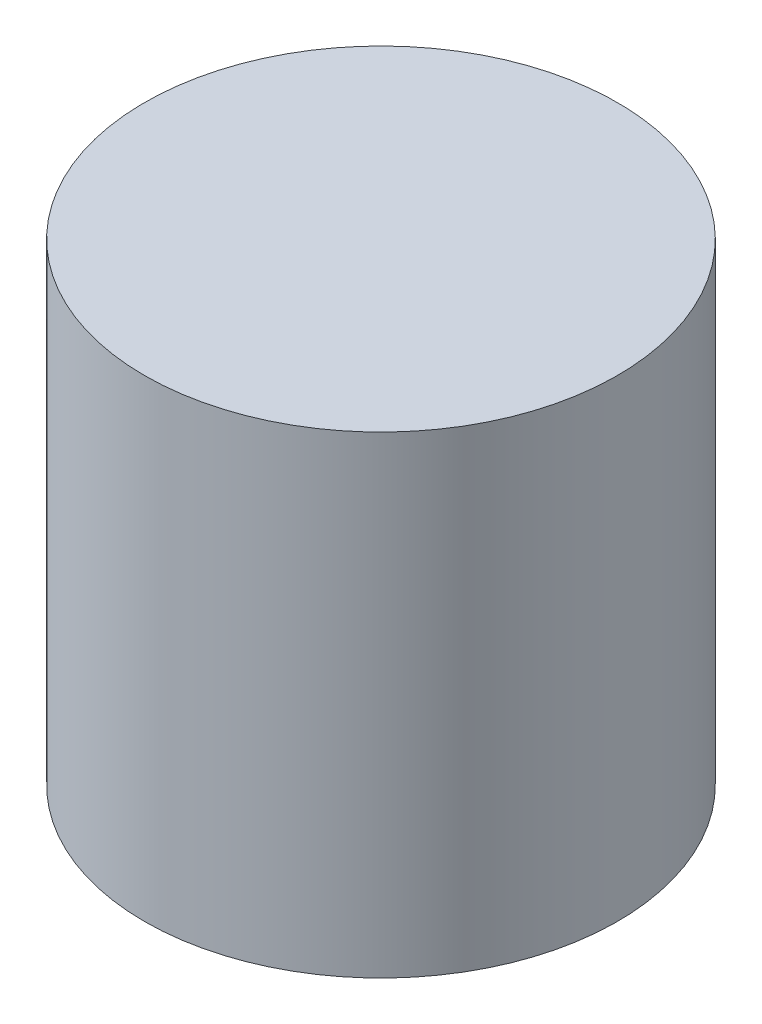
ISO-10303-21;
HEADER;
FILE_DESCRIPTION(('STEP AP214'),'2;1');
FILE_NAME('part.step','',(''),(''),'','','');
FILE_SCHEMA(('AUTOMOTIVE_DESIGN { 1 0 10303 214 1 1 1 1 }'));
ENDSEC;
DATA;
#1=APPLICATION_CONTEXT('core data for automotive mechanical design processes');
#2=APPLICATION_PROTOCOL_DEFINITION('international standard','automotive_design',2000,#1);
#3=PRODUCT_CONTEXT('',#1,'mechanical');
#4=PRODUCT('Part','Part','',(#3));
#5=PRODUCT_RELATED_PRODUCT_CATEGORY('part','',(#4));
#6=PRODUCT_DEFINITION_FORMATION('','',#4);
#7=PRODUCT_DEFINITION_CONTEXT('part definition',#1,'design');
#8=PRODUCT_DEFINITION('design','',#6,#7);
#9=PRODUCT_DEFINITION_SHAPE('','',#8);
#10=(LENGTH_UNIT() NAMED_UNIT(*) SI_UNIT(.MILLI.,.METRE.));
#11=(NAMED_UNIT(*) PLANE_ANGLE_UNIT() SI_UNIT($,.RADIAN.));
#12=(NAMED_UNIT(*) SI_UNIT($,.STERADIAN.) SOLID_ANGLE_UNIT());
#13=UNCERTAINTY_MEASURE_WITH_UNIT(LENGTH_MEASURE(1.E-05),#10,'distance_accuracy_value','');
#14=(GEOMETRIC_REPRESENTATION_CONTEXT(3) GLOBAL_UNCERTAINTY_ASSIGNED_CONTEXT((#13)) GLOBAL_UNIT_ASSIGNED_CONTEXT((#10,
#11,#12)) REPRESENTATION_CONTEXT('',''));
#15=CARTESIAN_POINT('',(0.,0.,0.));
#16=DIRECTION('',(0.,0.,1.));
#17=DIRECTION('',(1.,0.,0.));
#18=AXIS2_PLACEMENT_3D('',#15,#16,#17);
#19=CARTESIAN_POINT('',(-57.4701705723759,127.,-30.8636101222019));
#20=DIRECTION('',(0.,-1.,0.));
#21=DIRECTION('',(0.,0.,-1.));
#22=AXIS2_PLACEMENT_3D('',#19,#20,#21);
#23=CYLINDRICAL_SURFACE('',#22,63.5);
#24=CARTESIAN_POINT('',(-57.4701705723759,127.,-30.8636101222019));
#25=DIRECTION('',(0.,1.,0.));
#26=DIRECTION('',(0.,0.,1.));
#27=AXIS2_PLACEMENT_3D('',#24,#25,#26);
#28=CIRCLE('',#27,63.5);
#29=CARTESIAN_POINT('',(-57.4701705723759,127.,32.6363898777981));
#30=VERTEX_POINT('',#29);
#31=EDGE_CURVE('E10',#30,#30,#28,.T.);
#32=ORIENTED_EDGE('',*,*,#31,.F.);
#33=EDGE_LOOP('',(#32));
#34=FACE_BOUND('',#33,.T.);
#35=CARTESIAN_POINT('',(-57.4701705723759,0.,-30.8636101222019));
#36=DIRECTION('',(0.,1.,0.));
#37=DIRECTION('',(0.,0.,1.));
#38=AXIS2_PLACEMENT_3D('',#35,#36,#37);
#39=CIRCLE('',#38,63.5);
#40=CARTESIAN_POINT('',(-57.4701705723759,0.,32.6363898777981));
#41=VERTEX_POINT('',#40);
#42=EDGE_CURVE('E40',#41,#41,#39,.T.);
#43=ORIENTED_EDGE('',*,*,#42,.T.);
#44=EDGE_LOOP('',(#43));
#45=FACE_BOUND('',#44,.T.);
#46=ADVANCED_FACE('F37',(#34,#45),#23,.T.);
#47=CARTESIAN_POINT('',(-57.4701705723759,127.,-30.8636101222019));
#48=DIRECTION('',(0.,1.,0.));
#49=DIRECTION('',(0.,0.,1.));
#50=AXIS2_PLACEMENT_3D('',#47,#48,#49);
#51=PLANE('',#50);
#52=ORIENTED_EDGE('',*,*,#31,.T.);
#53=EDGE_LOOP('',(#52));
#54=FACE_BOUND('',#53,.T.);
#55=ADVANCED_FACE('F54',(#54),#51,.T.);
#56=CARTESIAN_POINT('',(-57.4701705723759,0.,-30.8636101222019));
#57=DIRECTION('',(0.,1.,0.));
#58=DIRECTION('',(0.,0.,1.));
#59=AXIS2_PLACEMENT_3D('',#56,#57,#58);
#60=PLANE('',#59);
#61=ORIENTED_EDGE('',*,*,#42,.F.);
#62=EDGE_LOOP('',(#61));
#63=FACE_BOUND('',#62,.T.);
#64=ADVANCED_FACE('F52',(#63),#60,.F.);
#65=CLOSED_SHELL('',(#46,#55,#64));
#66=MANIFOLD_SOLID_BREP('B2',#65);
#67=ADVANCED_BREP_SHAPE_REPRESENTATION('',(#18,#66),#14);
#68=SHAPE_DEFINITION_REPRESENTATION(#9,#67);
ENDSEC;
END-ISO-10303-21;
